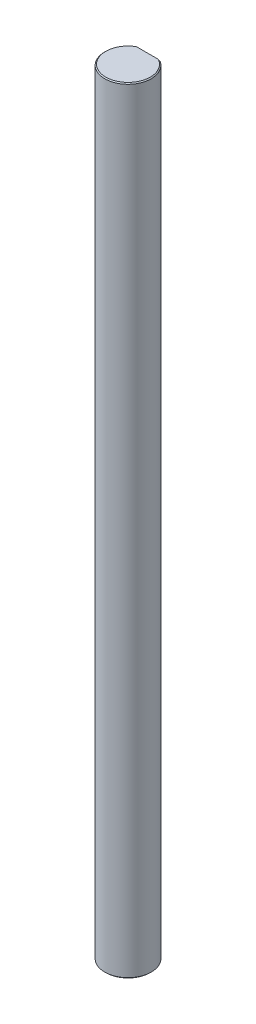
ISO-10303-21;
HEADER;
FILE_DESCRIPTION(('STEP AP214'),'2;1');
FILE_NAME('part.step','',(''),(''),'','','');
FILE_SCHEMA(('AUTOMOTIVE_DESIGN { 1 0 10303 214 1 1 1 1 }'));
ENDSEC;
DATA;
#1=APPLICATION_CONTEXT('core data for automotive mechanical design processes');
#2=APPLICATION_PROTOCOL_DEFINITION('international standard','automotive_design',2000,#1);
#3=PRODUCT_CONTEXT('',#1,'mechanical');
#4=PRODUCT('Part','Part','',(#3));
#5=PRODUCT_RELATED_PRODUCT_CATEGORY('part','',(#4));
#6=PRODUCT_DEFINITION_FORMATION('','',#4);
#7=PRODUCT_DEFINITION_CONTEXT('part definition',#1,'design');
#8=PRODUCT_DEFINITION('design','',#6,#7);
#9=PRODUCT_DEFINITION_SHAPE('','',#8);
#10=(LENGTH_UNIT() NAMED_UNIT(*) SI_UNIT(.MILLI.,.METRE.));
#11=(NAMED_UNIT(*) PLANE_ANGLE_UNIT() SI_UNIT($,.RADIAN.));
#12=(NAMED_UNIT(*) SI_UNIT($,.STERADIAN.) SOLID_ANGLE_UNIT());
#13=UNCERTAINTY_MEASURE_WITH_UNIT(LENGTH_MEASURE(1.E-05),#10,'distance_accuracy_value','');
#14=(GEOMETRIC_REPRESENTATION_CONTEXT(3) GLOBAL_UNCERTAINTY_ASSIGNED_CONTEXT((#13)) GLOBAL_UNIT_ASSIGNED_CONTEXT((#10,
#11,#12)) REPRESENTATION_CONTEXT('',''));
#15=CARTESIAN_POINT('',(0.,0.,0.));
#16=DIRECTION('',(0.,0.,1.));
#17=DIRECTION('',(1.,0.,0.));
#18=AXIS2_PLACEMENT_3D('',#15,#16,#17);
#19=CARTESIAN_POINT('',(0.,100.,0.));
#20=DIRECTION('',(0.,-1.,0.));
#21=DIRECTION('',(0.,0.,-1.));
#22=AXIS2_PLACEMENT_3D('',#19,#20,#21);
#23=CONICAL_SURFACE('',#22,2.875,0.785398163397384);
#24=CARTESIAN_POINT('',(-1.6583123951777,99.875,-2.5));
#25=CARTESIAN_POINT('',(-1.57973572193477,99.9184348904035,-2.5));
#26=CARTESIAN_POINT('',(-1.50022900034242,99.9602466964647,-2.5));
#27=CARTESIAN_POINT('',(-1.4197270864501,100.,-2.5));
#28=(BOUNDED_CURVE() B_SPLINE_CURVE(3,(#24,#25,#26,#27),.UNSPECIFIED.,.F.,
.F.) B_SPLINE_CURVE_WITH_KNOTS((4,4),(0.,0.000269347265701072),
.UNSPECIFIED.) CURVE() GEOMETRIC_REPRESENTATION_ITEM() RATIONAL_B_SPLINE_CURVE((1.,1.,1.,1.)) REPRESENTATION_ITEM(''));
#29=CARTESIAN_POINT('',(-1.6583123951777,99.875,-2.5));
#30=VERTEX_POINT('',#29);
#31=CARTESIAN_POINT('',(-1.4197270864501,100.,-2.5));
#32=VERTEX_POINT('',#31);
#33=EDGE_CURVE('E19',#30,#32,#28,.T.);
#34=ORIENTED_EDGE('',*,*,#33,.F.);
#35=CARTESIAN_POINT('',(0.,99.875,0.));
#36=DIRECTION('',(0.,-1.,0.));
#37=DIRECTION('',(0.,0.,1.));
#38=AXIS2_PLACEMENT_3D('',#35,#36,#37);
#39=CIRCLE('',#38,3.);
#40=CARTESIAN_POINT('',(1.6583123951777,99.875,-2.5));
#41=VERTEX_POINT('',#40);
#42=EDGE_CURVE('E104',#41,#30,#39,.T.);
#43=ORIENTED_EDGE('',*,*,#42,.F.);
#44=CARTESIAN_POINT('',(1.4197270864501,100.,-2.5));
#45=CARTESIAN_POINT('',(1.50022900034241,99.9602466964647,-2.5));
#46=CARTESIAN_POINT('',(1.57973572193477,99.9184348904036,-2.5));
#47=CARTESIAN_POINT('',(1.6583123951777,99.875,-2.5));
#48=(BOUNDED_CURVE() B_SPLINE_CURVE(3,(#44,#45,#46,#47),.UNSPECIFIED.,.F.,
.F.) B_SPLINE_CURVE_WITH_KNOTS((4,4),(0.,0.00026934726570107),
.UNSPECIFIED.) CURVE() GEOMETRIC_REPRESENTATION_ITEM() RATIONAL_B_SPLINE_CURVE((1.,1.,1.,1.)) REPRESENTATION_ITEM(''));
#49=CARTESIAN_POINT('',(1.4197270864501,100.,-2.5));
#50=VERTEX_POINT('',#49);
#51=EDGE_CURVE('E76',#50,#41,#48,.T.);
#52=ORIENTED_EDGE('',*,*,#51,.F.);
#53=CARTESIAN_POINT('',(0.,100.,0.));
#54=DIRECTION('',(0.,1.,0.));
#55=DIRECTION('',(0.,0.,1.));
#56=AXIS2_PLACEMENT_3D('',#53,#54,#55);
#57=CIRCLE('',#56,2.875);
#58=EDGE_CURVE('E28',#32,#50,#57,.T.);
#59=ORIENTED_EDGE('',*,*,#58,.F.);
#60=EDGE_LOOP('',(#34,#43,#52,#59));
#61=FACE_BOUND('',#60,.T.);
#62=ADVANCED_FACE('F15',(#61),#23,.T.);
#63=CARTESIAN_POINT('',(0.,0.124999999999972,0.));
#64=DIRECTION('',(0.,1.,0.));
#65=DIRECTION('',(0.,0.,1.));
#66=AXIS2_PLACEMENT_3D('',#63,#64,#65);
#67=CONICAL_SURFACE('',#66,3.,0.785398163397493);
#68=DIRECTION('',(0.,0.707106781186516,0.707106781186579));
#69=VECTOR('',#68,1.);
#70=CARTESIAN_POINT('',(0.,0.124999999999972,3.));
#71=LINE('',#70,#69);
#72=CARTESIAN_POINT('',(0.,0.,2.875));
#73=VERTEX_POINT('',#72);
#74=CARTESIAN_POINT('',(0.,0.124999999999972,3.));
#75=VERTEX_POINT('',#74);
#76=EDGE_CURVE('E89',#73,#75,#71,.T.);
#77=ORIENTED_EDGE('',*,*,#76,.F.);
#78=CARTESIAN_POINT('',(0.,0.,0.));
#79=DIRECTION('',(0.,-1.,0.));
#80=DIRECTION('',(0.,0.,1.));
#81=AXIS2_PLACEMENT_3D('',#78,#79,#80);
#82=CIRCLE('',#81,2.875);
#83=CARTESIAN_POINT('',(1.4197270864501,0.,-2.5));
#84=VERTEX_POINT('',#83);
#85=EDGE_CURVE('E10',#84,#73,#82,.T.);
#86=ORIENTED_EDGE('',*,*,#85,.F.);
#87=CARTESIAN_POINT('',(1.6583123951777,0.124999999999972,-2.5));
#88=CARTESIAN_POINT('',(1.57973572193477,0.0815651095964483,-2.5));
#89=CARTESIAN_POINT('',(1.50022900034242,0.0397533035352685,-2.5));
#90=CARTESIAN_POINT('',(1.4197270864501,0.,-2.5));
#91=(BOUNDED_CURVE() B_SPLINE_CURVE(3,(#87,#88,#89,#90),.UNSPECIFIED.,.F.,
.F.) B_SPLINE_CURVE_WITH_KNOTS((4,4),(0.,0.000269347265701057),
.UNSPECIFIED.) CURVE() GEOMETRIC_REPRESENTATION_ITEM() RATIONAL_B_SPLINE_CURVE((1.,1.,1.,1.)) REPRESENTATION_ITEM(''));
#92=CARTESIAN_POINT('',(1.6583123951777,0.124999999999972,-2.5));
#93=VERTEX_POINT('',#92);
#94=EDGE_CURVE('E87',#93,#84,#91,.T.);
#95=ORIENTED_EDGE('',*,*,#94,.F.);
#96=CARTESIAN_POINT('',(0.,0.124999999999972,0.));
#97=DIRECTION('',(0.,1.,0.));
#98=DIRECTION('',(0.,0.,1.));
#99=AXIS2_PLACEMENT_3D('',#96,#97,#98);
#100=CIRCLE('',#99,3.);
#101=EDGE_CURVE('E133',#75,#93,#100,.T.);
#102=ORIENTED_EDGE('',*,*,#101,.F.);
#103=EDGE_LOOP('',(#77,#86,#95,#102));
#104=FACE_BOUND('',#103,.T.);
#105=ADVANCED_FACE('F85',(#104),#67,.T.);
#106=CARTESIAN_POINT('',(0.,0.,0.));
#107=DIRECTION('',(0.,1.,0.));
#108=DIRECTION('',(1.,0.,0.));
#109=AXIS2_PLACEMENT_3D('',#106,#107,#108);
#110=PLANE('',#109);
#111=DIRECTION('',(1.,0.,0.));
#112=VECTOR('',#111,1.);
#113=CARTESIAN_POINT('',(0.,0.,-2.5));
#114=LINE('',#113,#112);
#115=CARTESIAN_POINT('',(-1.4197270864501,0.,-2.5));
#116=VERTEX_POINT('',#115);
#117=EDGE_CURVE('E93',#116,#84,#114,.T.);
#118=ORIENTED_EDGE('',*,*,#117,.T.);
#119=ORIENTED_EDGE('',*,*,#85,.T.);
#120=CARTESIAN_POINT('',(0.,0.,0.));
#121=DIRECTION('',(0.,-1.,0.));
#122=DIRECTION('',(0.,0.,1.));
#123=AXIS2_PLACEMENT_3D('',#120,#121,#122);
#124=CIRCLE('',#123,2.875);
#125=EDGE_CURVE('E95',#73,#116,#124,.T.);
#126=ORIENTED_EDGE('',*,*,#125,.T.);
#127=EDGE_LOOP('',(#118,#119,#126));
#128=FACE_BOUND('',#127,.T.);
#129=ADVANCED_FACE('F94',(#128),#110,.F.);
#130=CARTESIAN_POINT('',(0.,100.,0.));
#131=DIRECTION('',(0.,1.,0.));
#132=DIRECTION('',(1.,0.,0.));
#133=AXIS2_PLACEMENT_3D('',#130,#131,#132);
#134=PLANE('',#133);
#135=DIRECTION('',(1.,0.,0.));
#136=VECTOR('',#135,1.);
#137=CARTESIAN_POINT('',(0.,100.,-2.5));
#138=LINE('',#137,#136);
#139=EDGE_CURVE('E127',#32,#50,#138,.T.);
#140=ORIENTED_EDGE('',*,*,#139,.F.);
#141=ORIENTED_EDGE('',*,*,#58,.T.);
#142=EDGE_LOOP('',(#140,#141));
#143=FACE_BOUND('',#142,.T.);
#144=ADVANCED_FACE('F203',(#143),#134,.T.);
#145=CARTESIAN_POINT('',(0.,100.,-2.5));
#146=DIRECTION('',(0.,0.,-1.));
#147=DIRECTION('',(0.,-1.,0.));
#148=AXIS2_PLACEMENT_3D('',#145,#146,#147);
#149=PLANE('',#148);
#150=DIRECTION('',(0.,-1.,0.));
#151=VECTOR('',#150,1.);
#152=CARTESIAN_POINT('',(1.6583123951777,100.,-2.5));
#153=LINE('',#152,#151);
#154=EDGE_CURVE('E101',#41,#93,#153,.T.);
#155=ORIENTED_EDGE('',*,*,#154,.T.);
#156=ORIENTED_EDGE('',*,*,#94,.T.);
#157=ORIENTED_EDGE('',*,*,#117,.F.);
#158=CARTESIAN_POINT('',(-1.4197270864501,0.,-2.5));
#159=CARTESIAN_POINT('',(-1.50022900034241,0.0397533035352923,-2.5));
#160=CARTESIAN_POINT('',(-1.57973572193477,0.081565109596436,-2.5));
#161=CARTESIAN_POINT('',(-1.6583123951777,0.124999999999972,-2.5));
#162=(BOUNDED_CURVE() B_SPLINE_CURVE(3,(#158,#159,#160,#161),.UNSPECIFIED.,.F.,
.F.) B_SPLINE_CURVE_WITH_KNOTS((4,4),(0.,0.000269347265701057),
.UNSPECIFIED.) CURVE() GEOMETRIC_REPRESENTATION_ITEM() RATIONAL_B_SPLINE_CURVE((1.,1.,1.,1.)) REPRESENTATION_ITEM(''));
#163=CARTESIAN_POINT('',(-1.6583123951777,0.124999999999972,-2.5));
#164=VERTEX_POINT('',#163);
#165=EDGE_CURVE('E136',#116,#164,#162,.T.);
#166=ORIENTED_EDGE('',*,*,#165,.T.);
#167=DIRECTION('',(0.,-1.,0.));
#168=VECTOR('',#167,1.);
#169=CARTESIAN_POINT('',(-1.6583123951777,100.,-2.5));
#170=LINE('',#169,#168);
#171=EDGE_CURVE('E117',#30,#164,#170,.T.);
#172=ORIENTED_EDGE('',*,*,#171,.F.);
#173=ORIENTED_EDGE('',*,*,#33,.T.);
#174=ORIENTED_EDGE('',*,*,#139,.T.);
#175=ORIENTED_EDGE('',*,*,#51,.T.);
#176=EDGE_LOOP('',(#155,#156,#157,#166,#172,#173,#174,#175));
#177=FACE_BOUND('',#176,.T.);
#178=ADVANCED_FACE('F17',(#177),#149,.T.);
#179=CARTESIAN_POINT('',(0.,100.,0.));
#180=DIRECTION('',(0.,-1.,0.));
#181=DIRECTION('',(0.,0.,-1.));
#182=AXIS2_PLACEMENT_3D('',#179,#180,#181);
#183=CYLINDRICAL_SURFACE('',#182,3.);
#184=ORIENTED_EDGE('',*,*,#171,.T.);
#185=CARTESIAN_POINT('',(0.,0.124999999999972,0.));
#186=DIRECTION('',(0.,1.,0.));
#187=DIRECTION('',(0.,0.,1.));
#188=AXIS2_PLACEMENT_3D('',#185,#186,#187);
#189=CIRCLE('',#188,3.);
#190=EDGE_CURVE('E122',#164,#75,#189,.T.);
#191=ORIENTED_EDGE('',*,*,#190,.T.);
#192=ORIENTED_EDGE('',*,*,#101,.T.);
#193=ORIENTED_EDGE('',*,*,#154,.F.);
#194=ORIENTED_EDGE('',*,*,#42,.T.);
#195=EDGE_LOOP('',(#184,#191,#192,#193,#194));
#196=FACE_BOUND('',#195,.T.);
#197=ADVANCED_FACE('F148',(#196),#183,.T.);
#198=CARTESIAN_POINT('',(0.,0.124999999999972,0.));
#199=DIRECTION('',(0.,1.,0.));
#200=DIRECTION('',(0.,0.,1.));
#201=AXIS2_PLACEMENT_3D('',#198,#199,#200);
#202=CONICAL_SURFACE('',#201,3.,0.785398163397493);
#203=ORIENTED_EDGE('',*,*,#125,.F.);
#204=ORIENTED_EDGE('',*,*,#76,.T.);
#205=ORIENTED_EDGE('',*,*,#190,.F.);
#206=ORIENTED_EDGE('',*,*,#165,.F.);
#207=EDGE_LOOP('',(#203,#204,#205,#206));
#208=FACE_BOUND('',#207,.T.);
#209=ADVANCED_FACE('F211',(#208),#202,.T.);
#210=CLOSED_SHELL('',(#62,#105,#129,#144,#178,#197,#209));
#211=MANIFOLD_SOLID_BREP('B1',#210);
#212=ADVANCED_BREP_SHAPE_REPRESENTATION('',(#18,#211),#14);
#213=SHAPE_DEFINITION_REPRESENTATION(#9,#212);
ENDSEC;
END-ISO-10303-21;
